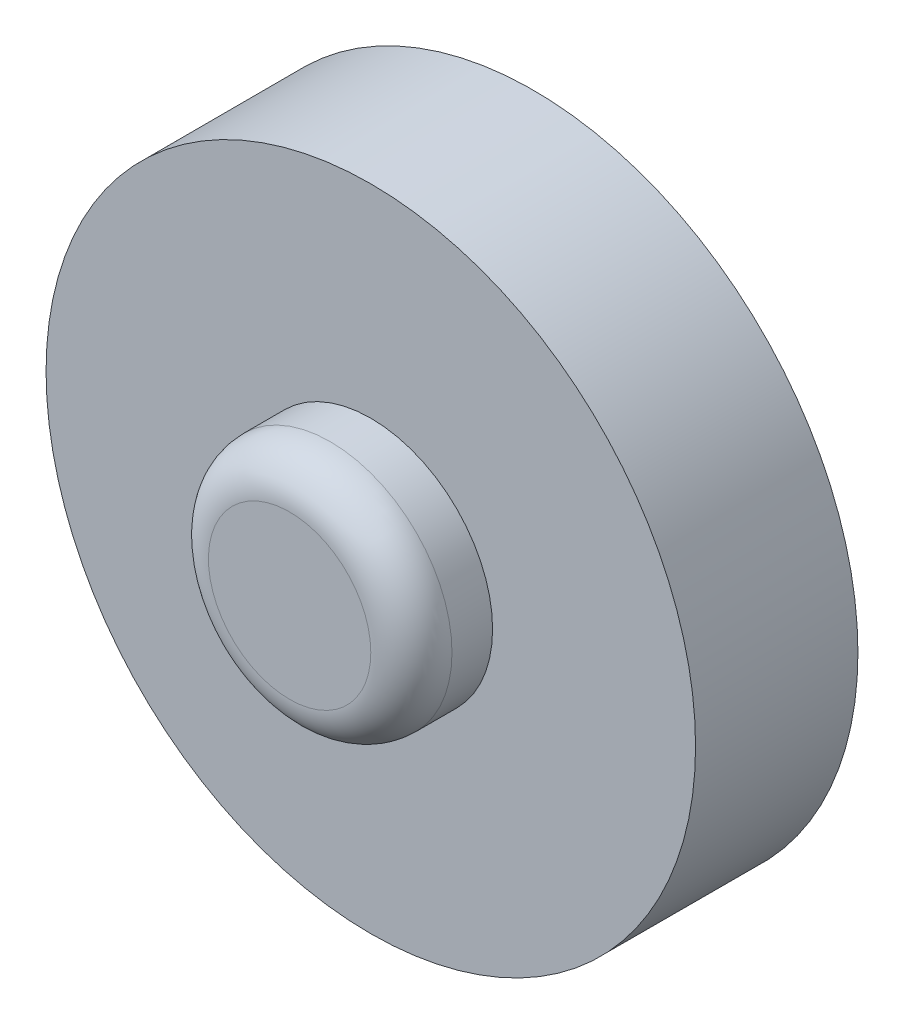
ISO-10303-21;
HEADER;
FILE_DESCRIPTION(('STEP AP214'),'2;1');
FILE_NAME('part.step','',(''),(''),'','','');
FILE_SCHEMA(('AUTOMOTIVE_DESIGN { 1 0 10303 214 1 1 1 1 }'));
ENDSEC;
DATA;
#1=APPLICATION_CONTEXT('core data for automotive mechanical design processes');
#2=APPLICATION_PROTOCOL_DEFINITION('international standard','automotive_design',2000,#1);
#3=PRODUCT_CONTEXT('',#1,'mechanical');
#4=PRODUCT('Part','Part','',(#3));
#5=PRODUCT_RELATED_PRODUCT_CATEGORY('part','',(#4));
#6=PRODUCT_DEFINITION_FORMATION('','',#4);
#7=PRODUCT_DEFINITION_CONTEXT('part definition',#1,'design');
#8=PRODUCT_DEFINITION('design','',#6,#7);
#9=PRODUCT_DEFINITION_SHAPE('','',#8);
#10=(LENGTH_UNIT() NAMED_UNIT(*) SI_UNIT(.MILLI.,.METRE.));
#11=(NAMED_UNIT(*) PLANE_ANGLE_UNIT() SI_UNIT($,.RADIAN.));
#12=(NAMED_UNIT(*) SI_UNIT($,.STERADIAN.) SOLID_ANGLE_UNIT());
#13=UNCERTAINTY_MEASURE_WITH_UNIT(LENGTH_MEASURE(1.E-05),#10,'distance_accuracy_value','');
#14=(GEOMETRIC_REPRESENTATION_CONTEXT(3) GLOBAL_UNCERTAINTY_ASSIGNED_CONTEXT((#13)) GLOBAL_UNIT_ASSIGNED_CONTEXT((#10,
#11,#12)) REPRESENTATION_CONTEXT('',''));
#15=CARTESIAN_POINT('',(0.,0.,0.));
#16=DIRECTION('',(0.,0.,1.));
#17=DIRECTION('',(1.,0.,0.));
#18=AXIS2_PLACEMENT_3D('',#15,#16,#17);
#19=CARTESIAN_POINT('',(0.,0.,-38.1));
#20=DIRECTION('',(0.,0.,-1.));
#21=DIRECTION('',(0.,-1.,0.));
#22=AXIS2_PLACEMENT_3D('',#19,#20,#21);
#23=TOROIDAL_SURFACE('',#22,25.4,12.7);
#24=CARTESIAN_POINT('',(0.,0.,-38.1));
#25=DIRECTION('',(0.,0.,-1.));
#26=DIRECTION('',(0.,-1.,0.));
#27=AXIS2_PLACEMENT_3D('',#24,#25,#26);
#28=CIRCLE('',#27,38.1);
#29=CARTESIAN_POINT('',(0.,-38.1,-38.1));
#30=VERTEX_POINT('',#29);
#31=EDGE_CURVE('E8',#30,#30,#28,.T.);
#32=ORIENTED_EDGE('',*,*,#31,.T.);
#33=EDGE_LOOP('',(#32));
#34=FACE_BOUND('',#33,.T.);
#35=CARTESIAN_POINT('',(0.,0.,-50.8));
#36=DIRECTION('',(0.,0.,1.));
#37=DIRECTION('',(1.,0.,0.));
#38=AXIS2_PLACEMENT_3D('',#35,#36,#37);
#39=CIRCLE('',#38,25.4);
#40=CARTESIAN_POINT('',(25.4,0.,-50.8));
#41=VERTEX_POINT('',#40);
#42=EDGE_CURVE('E21',#41,#41,#39,.T.);
#43=ORIENTED_EDGE('',*,*,#42,.T.);
#44=EDGE_LOOP('',(#43));
#45=FACE_BOUND('',#44,.T.);
#46=ADVANCED_FACE('F13',(#34,#45),#23,.T.);
#47=CARTESIAN_POINT('',(0.,0.,-50.8));
#48=DIRECTION('',(0.,0.,-1.));
#49=DIRECTION('',(0.,-1.,0.));
#50=AXIS2_PLACEMENT_3D('',#47,#48,#49);
#51=CYLINDRICAL_SURFACE('',#50,38.1);
#52=CARTESIAN_POINT('',(0.,0.,-25.4));
#53=DIRECTION('',(0.,0.,1.));
#54=DIRECTION('',(1.,0.,0.));
#55=AXIS2_PLACEMENT_3D('',#52,#53,#54);
#56=CIRCLE('',#55,38.1);
#57=CARTESIAN_POINT('',(38.1,0.,-25.4));
#58=VERTEX_POINT('',#57);
#59=EDGE_CURVE('E29',#58,#58,#56,.T.);
#60=ORIENTED_EDGE('',*,*,#59,.F.);
#61=EDGE_LOOP('',(#60));
#62=FACE_BOUND('',#61,.T.);
#63=ORIENTED_EDGE('',*,*,#31,.F.);
#64=EDGE_LOOP('',(#63));
#65=FACE_BOUND('',#64,.T.);
#66=ADVANCED_FACE('F63',(#62,#65),#51,.T.);
#67=CARTESIAN_POINT('',(0.,0.,-50.8));
#68=DIRECTION('',(0.,0.,-1.));
#69=DIRECTION('',(-1.,0.,0.));
#70=AXIS2_PLACEMENT_3D('',#67,#68,#69);
#71=PLANE('',#70);
#72=ORIENTED_EDGE('',*,*,#42,.F.);
#73=EDGE_LOOP('',(#72));
#74=FACE_BOUND('',#73,.T.);
#75=ADVANCED_FACE('F68',(#74),#71,.T.);
#76=CARTESIAN_POINT('',(0.,0.,38.1));
#77=DIRECTION('',(0.,0.,1.));
#78=DIRECTION('',(1.,0.,0.));
#79=AXIS2_PLACEMENT_3D('',#76,#77,#78);
#80=TOROIDAL_SURFACE('',#79,25.4,12.7);
#81=CARTESIAN_POINT('',(0.,0.,38.1));
#82=DIRECTION('',(0.,0.,1.));
#83=DIRECTION('',(1.,0.,0.));
#84=AXIS2_PLACEMENT_3D('',#81,#82,#83);
#85=CIRCLE('',#84,38.1);
#86=CARTESIAN_POINT('',(38.1,0.,38.1));
#87=VERTEX_POINT('',#86);
#88=EDGE_CURVE('E26',#87,#87,#85,.T.);
#89=ORIENTED_EDGE('',*,*,#88,.T.);
#90=EDGE_LOOP('',(#89));
#91=FACE_BOUND('',#90,.T.);
#92=CARTESIAN_POINT('',(0.,0.,50.8));
#93=DIRECTION('',(0.,0.,-1.));
#94=DIRECTION('',(0.,-1.,0.));
#95=AXIS2_PLACEMENT_3D('',#92,#93,#94);
#96=CIRCLE('',#95,25.4);
#97=CARTESIAN_POINT('',(0.,-25.4,50.8));
#98=VERTEX_POINT('',#97);
#99=EDGE_CURVE('E36',#98,#98,#96,.T.);
#100=ORIENTED_EDGE('',*,*,#99,.T.);
#101=EDGE_LOOP('',(#100));
#102=FACE_BOUND('',#101,.T.);
#103=ADVANCED_FACE('F75',(#91,#102),#80,.T.);
#104=CARTESIAN_POINT('',(0.,0.,50.8));
#105=DIRECTION('',(0.,0.,-1.));
#106=DIRECTION('',(0.,-1.,0.));
#107=AXIS2_PLACEMENT_3D('',#104,#105,#106);
#108=CYLINDRICAL_SURFACE('',#107,38.1);
#109=CARTESIAN_POINT('',(0.,0.,25.4));
#110=DIRECTION('',(0.,0.,1.));
#111=DIRECTION('',(1.,0.,0.));
#112=AXIS2_PLACEMENT_3D('',#109,#110,#111);
#113=CIRCLE('',#112,38.1);
#114=CARTESIAN_POINT('',(38.1,0.,25.4));
#115=VERTEX_POINT('',#114);
#116=EDGE_CURVE('E32',#115,#115,#113,.T.);
#117=ORIENTED_EDGE('',*,*,#116,.T.);
#118=EDGE_LOOP('',(#117));
#119=FACE_BOUND('',#118,.T.);
#120=ORIENTED_EDGE('',*,*,#88,.F.);
#121=EDGE_LOOP('',(#120));
#122=FACE_BOUND('',#121,.T.);
#123=ADVANCED_FACE('F78',(#119,#122),#108,.T.);
#124=CARTESIAN_POINT('',(0.,0.,50.8));
#125=DIRECTION('',(0.,0.,-1.));
#126=DIRECTION('',(-1.,0.,0.));
#127=AXIS2_PLACEMENT_3D('',#124,#125,#126);
#128=PLANE('',#127);
#129=ORIENTED_EDGE('',*,*,#99,.F.);
#130=EDGE_LOOP('',(#129));
#131=FACE_BOUND('',#130,.T.);
#132=ADVANCED_FACE('F57',(#131),#128,.F.);
#133=CARTESIAN_POINT('',(0.,0.,-25.4));
#134=DIRECTION('',(0.,0.,1.));
#135=DIRECTION('',(1.,0.,0.));
#136=AXIS2_PLACEMENT_3D('',#133,#134,#135);
#137=PLANE('',#136);
#138=ORIENTED_EDGE('',*,*,#59,.T.);
#139=EDGE_LOOP('',(#138));
#140=FACE_BOUND('',#139,.T.);
#141=CARTESIAN_POINT('',(0.,0.,-25.4));
#142=DIRECTION('',(0.,0.,1.));
#143=DIRECTION('',(1.,0.,0.));
#144=AXIS2_PLACEMENT_3D('',#141,#142,#143);
#145=CIRCLE('',#144,101.6);
#146=CARTESIAN_POINT('',(101.6,0.,-25.4));
#147=VERTEX_POINT('',#146);
#148=EDGE_CURVE('E33',#147,#147,#145,.T.);
#149=ORIENTED_EDGE('',*,*,#148,.F.);
#150=EDGE_LOOP('',(#149));
#151=FACE_BOUND('',#150,.T.);
#152=ADVANCED_FACE('F49',(#140,#151),#137,.F.);
#153=CARTESIAN_POINT('',(0.,0.,25.4));
#154=DIRECTION('',(0.,0.,-1.));
#155=DIRECTION('',(-1.,0.,0.));
#156=AXIS2_PLACEMENT_3D('',#153,#154,#155);
#157=PLANE('',#156);
#158=ORIENTED_EDGE('',*,*,#116,.F.);
#159=EDGE_LOOP('',(#158));
#160=FACE_BOUND('',#159,.T.);
#161=CARTESIAN_POINT('',(0.,0.,25.4));
#162=DIRECTION('',(0.,0.,-1.));
#163=DIRECTION('',(0.,-1.,0.));
#164=AXIS2_PLACEMENT_3D('',#161,#162,#163);
#165=CIRCLE('',#164,101.6);
#166=CARTESIAN_POINT('',(0.,-101.6,25.4));
#167=VERTEX_POINT('',#166);
#168=EDGE_CURVE('E17',#167,#167,#165,.T.);
#169=ORIENTED_EDGE('',*,*,#168,.F.);
#170=EDGE_LOOP('',(#169));
#171=FACE_BOUND('',#170,.T.);
#172=ADVANCED_FACE('F47',(#160,#171),#157,.F.);
#173=CARTESIAN_POINT('',(0.,0.,0.));
#174=DIRECTION('',(0.,0.,1.));
#175=DIRECTION('',(1.,0.,0.));
#176=AXIS2_PLACEMENT_3D('',#173,#174,#175);
#177=CYLINDRICAL_SURFACE('',#176,101.6);
#178=ORIENTED_EDGE('',*,*,#148,.T.);
#179=EDGE_LOOP('',(#178));
#180=FACE_BOUND('',#179,.T.);
#181=ORIENTED_EDGE('',*,*,#168,.T.);
#182=EDGE_LOOP('',(#181));
#183=FACE_BOUND('',#182,.T.);
#184=ADVANCED_FACE('F15',(#180,#183),#177,.T.);
#185=CLOSED_SHELL('',(#46,#66,#75,#103,#123,#132,#152,#172,#184));
#186=MANIFOLD_SOLID_BREP('B1',#185);
#187=ADVANCED_BREP_SHAPE_REPRESENTATION('',(#18,#186),#14);
#188=SHAPE_DEFINITION_REPRESENTATION(#9,#187);
ENDSEC;
END-ISO-10303-21;
